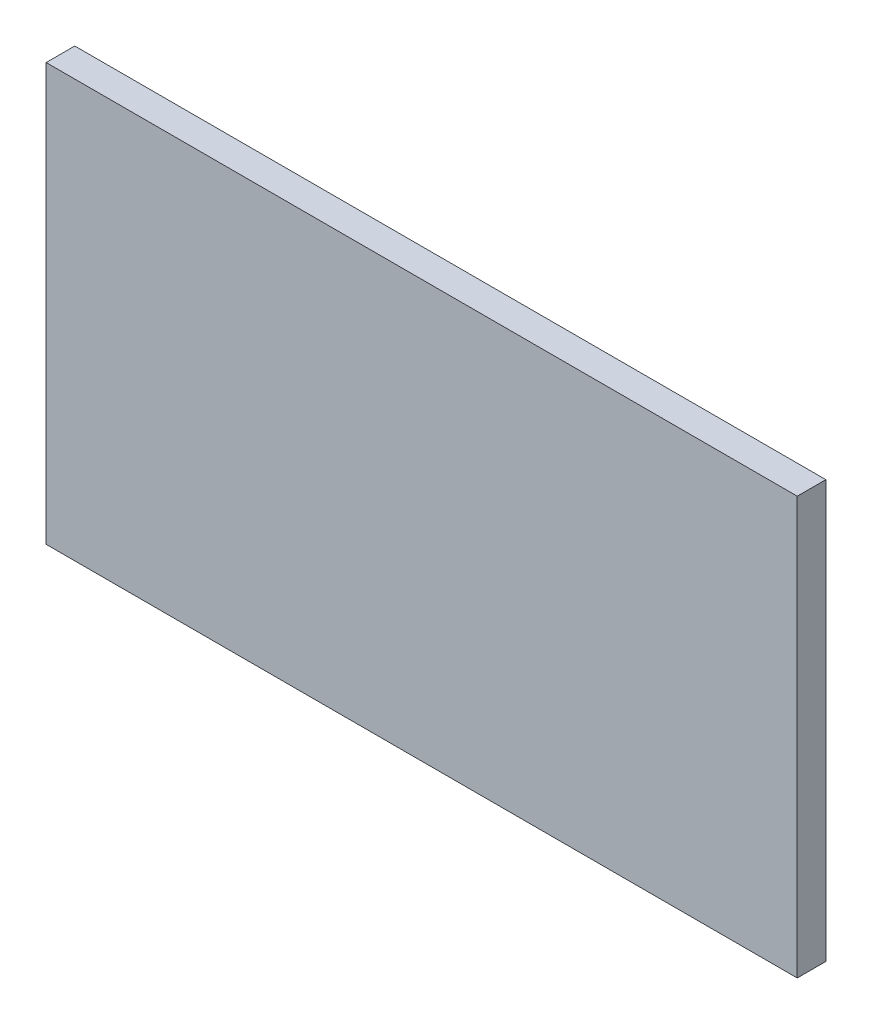
ISO-10303-21;
HEADER;
FILE_DESCRIPTION(('STEP AP214'),'2;1');
FILE_NAME('part.step','',(''),(''),'','','');
FILE_SCHEMA(('AUTOMOTIVE_DESIGN { 1 0 10303 214 1 1 1 1 }'));
ENDSEC;
DATA;
#1=APPLICATION_CONTEXT('core data for automotive mechanical design processes');
#2=APPLICATION_PROTOCOL_DEFINITION('international standard','automotive_design',2000,#1);
#3=PRODUCT_CONTEXT('',#1,'mechanical');
#4=PRODUCT('Part','Part','',(#3));
#5=PRODUCT_RELATED_PRODUCT_CATEGORY('part','',(#4));
#6=PRODUCT_DEFINITION_FORMATION('','',#4);
#7=PRODUCT_DEFINITION_CONTEXT('part definition',#1,'design');
#8=PRODUCT_DEFINITION('design','',#6,#7);
#9=PRODUCT_DEFINITION_SHAPE('','',#8);
#10=(LENGTH_UNIT() NAMED_UNIT(*) SI_UNIT(.MILLI.,.METRE.));
#11=(NAMED_UNIT(*) PLANE_ANGLE_UNIT() SI_UNIT($,.RADIAN.));
#12=(NAMED_UNIT(*) SI_UNIT($,.STERADIAN.) SOLID_ANGLE_UNIT());
#13=UNCERTAINTY_MEASURE_WITH_UNIT(LENGTH_MEASURE(1.E-05),#10,'distance_accuracy_value','');
#14=(GEOMETRIC_REPRESENTATION_CONTEXT(3) GLOBAL_UNCERTAINTY_ASSIGNED_CONTEXT((#13)) GLOBAL_UNIT_ASSIGNED_CONTEXT((#10,
#11,#12)) REPRESENTATION_CONTEXT('',''));
#15=CARTESIAN_POINT('',(0.,0.,0.));
#16=DIRECTION('',(0.,0.,1.));
#17=DIRECTION('',(1.,0.,0.));
#18=AXIS2_PLACEMENT_3D('',#15,#16,#17);
#19=CARTESIAN_POINT('',(12.50008,8.,0.));
#20=DIRECTION('',(0.,0.,-1.));
#21=DIRECTION('',(-1.,0.,0.));
#22=AXIS2_PLACEMENT_3D('',#19,#20,#21);
#23=PLANE('',#22);
#24=DIRECTION('',(1.,0.,0.));
#25=VECTOR('',#24,1.);
#26=CARTESIAN_POINT('',(12.05008,8.25,0.));
#27=LINE('',#26,#25);
#28=CARTESIAN_POINT('',(12.05008,8.25,0.));
#29=VERTEX_POINT('',#28);
#30=CARTESIAN_POINT('',(12.95008,8.25,0.));
#31=VERTEX_POINT('',#30);
#32=EDGE_CURVE('E55',#29,#31,#27,.T.);
#33=ORIENTED_EDGE('',*,*,#32,.T.);
#34=DIRECTION('',(0.,1.,0.));
#35=VECTOR('',#34,1.);
#36=CARTESIAN_POINT('',(12.95008,8.25,0.));
#37=LINE('',#36,#35);
#38=CARTESIAN_POINT('',(12.95008,7.75,0.));
#39=VERTEX_POINT('',#38);
#40=EDGE_CURVE('E57',#31,#39,#37,.F.);
#41=ORIENTED_EDGE('',*,*,#40,.T.);
#42=DIRECTION('',(1.,0.,0.));
#43=VECTOR('',#42,1.);
#44=CARTESIAN_POINT('',(12.95008,7.75,0.));
#45=LINE('',#44,#43);
#46=CARTESIAN_POINT('',(12.05008,7.75,0.));
#47=VERTEX_POINT('',#46);
#48=EDGE_CURVE('E20',#39,#47,#45,.F.);
#49=ORIENTED_EDGE('',*,*,#48,.T.);
#50=DIRECTION('',(0.,1.,0.));
#51=VECTOR('',#50,1.);
#52=CARTESIAN_POINT('',(12.05008,7.75,0.));
#53=LINE('',#52,#51);
#54=EDGE_CURVE('E80',#47,#29,#53,.T.);
#55=ORIENTED_EDGE('',*,*,#54,.T.);
#56=EDGE_LOOP('',(#33,#41,#49,#55));
#57=FACE_BOUND('',#56,.T.);
#58=ADVANCED_FACE('F17',(#57),#23,.T.);
#59=CARTESIAN_POINT('',(12.95008,7.75,0.));
#60=DIRECTION('',(0.,1.,0.));
#61=DIRECTION('',(0.,0.,1.));
#62=AXIS2_PLACEMENT_3D('',#59,#60,#61);
#63=PLANE('',#62);
#64=DIRECTION('',(0.,0.,-1.));
#65=VECTOR('',#64,1.);
#66=CARTESIAN_POINT('',(12.05008,7.75,0.));
#67=LINE('',#66,#65);
#68=CARTESIAN_POINT('',(12.05008,7.75,0.03429));
#69=VERTEX_POINT('',#68);
#70=EDGE_CURVE('E68',#69,#47,#67,.T.);
#71=ORIENTED_EDGE('',*,*,#70,.T.);
#72=ORIENTED_EDGE('',*,*,#48,.F.);
#73=DIRECTION('',(0.,0.,1.));
#74=VECTOR('',#73,1.);
#75=CARTESIAN_POINT('',(12.95008,7.75,0.));
#76=LINE('',#75,#74);
#77=CARTESIAN_POINT('',(12.95008,7.75,0.03429));
#78=VERTEX_POINT('',#77);
#79=EDGE_CURVE('E63',#39,#78,#76,.T.);
#80=ORIENTED_EDGE('',*,*,#79,.T.);
#81=DIRECTION('',(1.,0.,0.));
#82=VECTOR('',#81,1.);
#83=CARTESIAN_POINT('',(12.50008,7.75,0.03429));
#84=LINE('',#83,#82);
#85=EDGE_CURVE('E83',#69,#78,#84,.T.);
#86=ORIENTED_EDGE('',*,*,#85,.F.);
#87=EDGE_LOOP('',(#71,#72,#80,#86));
#88=FACE_BOUND('',#87,.T.);
#89=ADVANCED_FACE('F65',(#88),#63,.F.);
#90=CARTESIAN_POINT('',(12.95008,8.25,0.));
#91=DIRECTION('',(-1.,0.,0.));
#92=DIRECTION('',(0.,0.,1.));
#93=AXIS2_PLACEMENT_3D('',#90,#91,#92);
#94=PLANE('',#93);
#95=ORIENTED_EDGE('',*,*,#79,.F.);
#96=ORIENTED_EDGE('',*,*,#40,.F.);
#97=DIRECTION('',(0.,0.,-1.));
#98=VECTOR('',#97,1.);
#99=CARTESIAN_POINT('',(12.95008,8.25,0.));
#100=LINE('',#99,#98);
#101=CARTESIAN_POINT('',(12.95008,8.25,0.03429));
#102=VERTEX_POINT('',#101);
#103=EDGE_CURVE('E75',#31,#102,#100,.F.);
#104=ORIENTED_EDGE('',*,*,#103,.T.);
#105=DIRECTION('',(0.,1.,0.));
#106=VECTOR('',#105,1.);
#107=CARTESIAN_POINT('',(12.95008,8.,0.03429));
#108=LINE('',#107,#106);
#109=EDGE_CURVE('E72',#78,#102,#108,.T.);
#110=ORIENTED_EDGE('',*,*,#109,.F.);
#111=EDGE_LOOP('',(#95,#96,#104,#110));
#112=FACE_BOUND('',#111,.T.);
#113=ADVANCED_FACE('F70',(#112),#94,.F.);
#114=CARTESIAN_POINT('',(12.05008,8.25,0.));
#115=DIRECTION('',(0.,-1.,0.));
#116=DIRECTION('',(0.,0.,-1.));
#117=AXIS2_PLACEMENT_3D('',#114,#115,#116);
#118=PLANE('',#117);
#119=ORIENTED_EDGE('',*,*,#103,.F.);
#120=ORIENTED_EDGE('',*,*,#32,.F.);
#121=DIRECTION('',(0.,0.,-1.));
#122=VECTOR('',#121,1.);
#123=CARTESIAN_POINT('',(12.05008,8.25,0.));
#124=LINE('',#123,#122);
#125=CARTESIAN_POINT('',(12.05008,8.25,0.03429));
#126=VERTEX_POINT('',#125);
#127=EDGE_CURVE('E35',#29,#126,#124,.F.);
#128=ORIENTED_EDGE('',*,*,#127,.T.);
#129=DIRECTION('',(1.,0.,0.));
#130=VECTOR('',#129,1.);
#131=CARTESIAN_POINT('',(12.50008,8.25,0.03429));
#132=LINE('',#131,#130);
#133=EDGE_CURVE('E26',#102,#126,#132,.F.);
#134=ORIENTED_EDGE('',*,*,#133,.F.);
#135=EDGE_LOOP('',(#119,#120,#128,#134));
#136=FACE_BOUND('',#135,.T.);
#137=ADVANCED_FACE('F89',(#136),#118,.F.);
#138=CARTESIAN_POINT('',(12.05008,7.75,0.));
#139=DIRECTION('',(1.,0.,0.));
#140=DIRECTION('',(0.,0.,-1.));
#141=AXIS2_PLACEMENT_3D('',#138,#139,#140);
#142=PLANE('',#141);
#143=ORIENTED_EDGE('',*,*,#127,.F.);
#144=ORIENTED_EDGE('',*,*,#54,.F.);
#145=ORIENTED_EDGE('',*,*,#70,.F.);
#146=DIRECTION('',(0.,1.,0.));
#147=VECTOR('',#146,1.);
#148=CARTESIAN_POINT('',(12.05008,8.,0.03429));
#149=LINE('',#148,#147);
#150=EDGE_CURVE('E11',#126,#69,#149,.F.);
#151=ORIENTED_EDGE('',*,*,#150,.F.);
#152=EDGE_LOOP('',(#143,#144,#145,#151));
#153=FACE_BOUND('',#152,.T.);
#154=ADVANCED_FACE('F91',(#153),#142,.F.);
#155=CARTESIAN_POINT('',(12.50008,8.,0.03429));
#156=DIRECTION('',(0.,0.,1.));
#157=DIRECTION('',(1.,0.,0.));
#158=AXIS2_PLACEMENT_3D('',#155,#156,#157);
#159=PLANE('',#158);
#160=ORIENTED_EDGE('',*,*,#133,.T.);
#161=ORIENTED_EDGE('',*,*,#150,.T.);
#162=ORIENTED_EDGE('',*,*,#85,.T.);
#163=ORIENTED_EDGE('',*,*,#109,.T.);
#164=EDGE_LOOP('',(#160,#161,#162,#163));
#165=FACE_BOUND('',#164,.T.);
#166=ADVANCED_FACE('F88',(#165),#159,.T.);
#167=CLOSED_SHELL('',(#58,#89,#113,#137,#154,#166));
#168=MANIFOLD_SOLID_BREP('B1',#167);
#169=ADVANCED_BREP_SHAPE_REPRESENTATION('',(#18,#168),#14);
#170=SHAPE_DEFINITION_REPRESENTATION(#9,#169);
ENDSEC;
END-ISO-10303-21;
